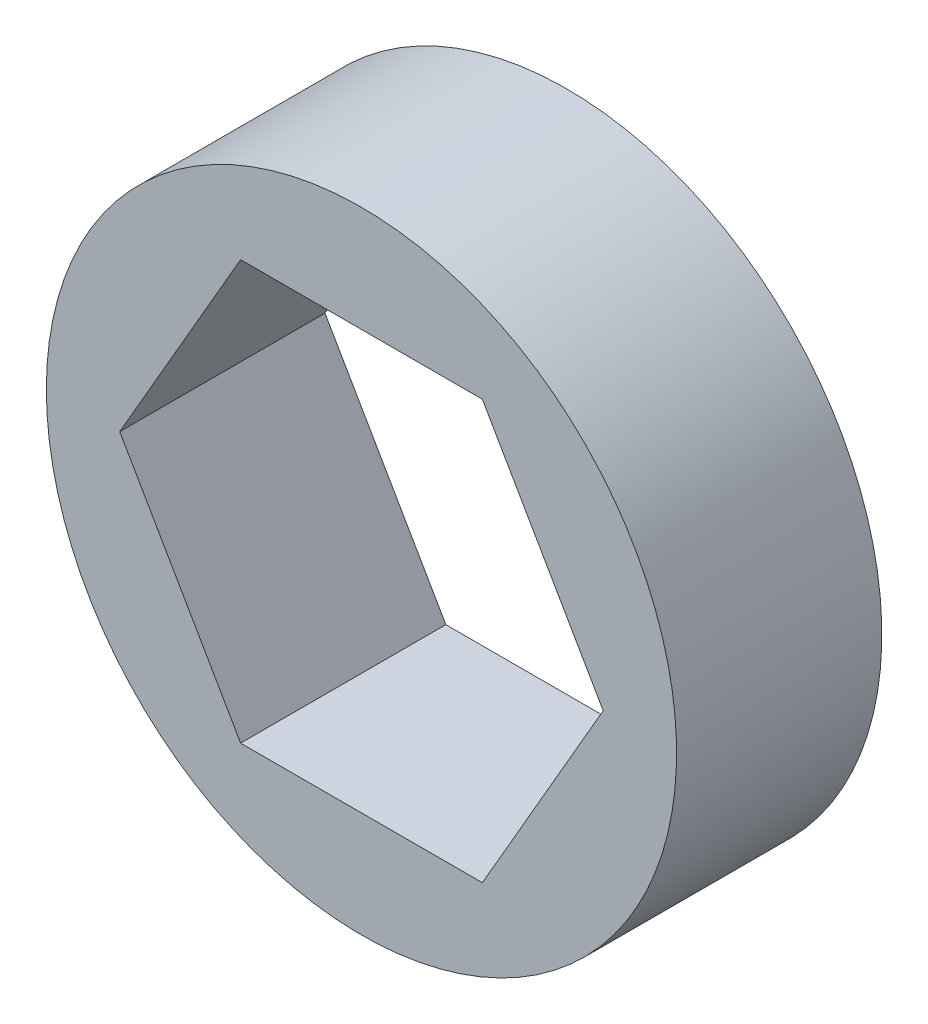
ISO-10303-21;
HEADER;
FILE_DESCRIPTION(('STEP AP214'),'2;1');
FILE_NAME('part.step','',(''),(''),'','','');
FILE_SCHEMA(('AUTOMOTIVE_DESIGN { 1 0 10303 214 1 1 1 1 }'));
ENDSEC;
DATA;
#1=APPLICATION_CONTEXT('core data for automotive mechanical design processes');
#2=APPLICATION_PROTOCOL_DEFINITION('international standard','automotive_design',2000,#1);
#3=PRODUCT_CONTEXT('',#1,'mechanical');
#4=PRODUCT('Part','Part','',(#3));
#5=PRODUCT_RELATED_PRODUCT_CATEGORY('part','',(#4));
#6=PRODUCT_DEFINITION_FORMATION('','',#4);
#7=PRODUCT_DEFINITION_CONTEXT('part definition',#1,'design');
#8=PRODUCT_DEFINITION('design','',#6,#7);
#9=PRODUCT_DEFINITION_SHAPE('','',#8);
#10=(LENGTH_UNIT() NAMED_UNIT(*) SI_UNIT(.MILLI.,.METRE.));
#11=(NAMED_UNIT(*) PLANE_ANGLE_UNIT() SI_UNIT($,.RADIAN.));
#12=(NAMED_UNIT(*) SI_UNIT($,.STERADIAN.) SOLID_ANGLE_UNIT());
#13=UNCERTAINTY_MEASURE_WITH_UNIT(LENGTH_MEASURE(1.E-05),#10,'distance_accuracy_value','');
#14=(GEOMETRIC_REPRESENTATION_CONTEXT(3) GLOBAL_UNCERTAINTY_ASSIGNED_CONTEXT((#13)) GLOBAL_UNIT_ASSIGNED_CONTEXT((#10,
#11,#12)) REPRESENTATION_CONTEXT('',''));
#15=CARTESIAN_POINT('',(0.,0.,0.));
#16=DIRECTION('',(0.,0.,1.));
#17=DIRECTION('',(1.,0.,0.));
#18=AXIS2_PLACEMENT_3D('',#15,#16,#17);
#19=CARTESIAN_POINT('',(-7.47899538708241,0.,3.175));
#20=DIRECTION('',(0.866025403784439,0.5,0.));
#21=DIRECTION('',(-0.5,0.866025403784439,0.));
#22=AXIS2_PLACEMENT_3D('',#19,#20,#21);
#23=PLANE('',#22);
#24=DIRECTION('',(-0.5,0.866025403784438,0.));
#25=VECTOR('',#24,1.);
#26=CARTESIAN_POINT('',(-3.73949769354121,-6.477,3.175));
#27=LINE('',#26,#25);
#28=CARTESIAN_POINT('',(-3.73949769354121,-6.477,3.175));
#29=VERTEX_POINT('',#28);
#30=CARTESIAN_POINT('',(-7.47899538708241,0.,3.175));
#31=VERTEX_POINT('',#30);
#32=EDGE_CURVE('E86',#29,#31,#27,.T.);
#33=ORIENTED_EDGE('',*,*,#32,.F.);
#34=DIRECTION('',(0.,0.,1.));
#35=VECTOR('',#34,1.);
#36=CARTESIAN_POINT('',(-3.73949769354121,-6.477,3.175));
#37=LINE('',#36,#35);
#38=CARTESIAN_POINT('',(-3.73949769354121,-6.477,-3.175));
#39=VERTEX_POINT('',#38);
#40=EDGE_CURVE('E78',#39,#29,#37,.T.);
#41=ORIENTED_EDGE('',*,*,#40,.F.);
#42=DIRECTION('',(-0.5,0.866025403784439,0.));
#43=VECTOR('',#42,1.);
#44=CARTESIAN_POINT('',(-3.73949769354121,-6.477,-3.175));
#45=LINE('',#44,#43);
#46=CARTESIAN_POINT('',(-7.47899538708241,0.,-3.175));
#47=VERTEX_POINT('',#46);
#48=EDGE_CURVE('E118',#39,#47,#45,.T.);
#49=ORIENTED_EDGE('',*,*,#48,.T.);
#50=DIRECTION('',(0.,0.,1.));
#51=VECTOR('',#50,1.);
#52=CARTESIAN_POINT('',(-7.47899538708241,0.,3.175));
#53=LINE('',#52,#51);
#54=EDGE_CURVE('E103',#31,#47,#53,.F.);
#55=ORIENTED_EDGE('',*,*,#54,.F.);
#56=EDGE_LOOP('',(#33,#41,#49,#55));
#57=FACE_BOUND('',#56,.T.);
#58=ADVANCED_FACE('F18',(#57),#23,.T.);
#59=CARTESIAN_POINT('',(-3.73949769354121,6.477,3.175));
#60=DIRECTION('',(0.866025403784439,-0.5,0.));
#61=DIRECTION('',(0.5,0.866025403784439,0.));
#62=AXIS2_PLACEMENT_3D('',#59,#60,#61);
#63=PLANE('',#62);
#64=DIRECTION('',(0.5,0.866025403784439,0.));
#65=VECTOR('',#64,1.);
#66=CARTESIAN_POINT('',(-7.47899538708242,0.,3.175));
#67=LINE('',#66,#65);
#68=CARTESIAN_POINT('',(-3.73949769354121,6.477,3.175));
#69=VERTEX_POINT('',#68);
#70=EDGE_CURVE('E111',#31,#69,#67,.T.);
#71=ORIENTED_EDGE('',*,*,#70,.F.);
#72=ORIENTED_EDGE('',*,*,#54,.T.);
#73=DIRECTION('',(0.5,0.866025403784439,0.));
#74=VECTOR('',#73,1.);
#75=CARTESIAN_POINT('',(-7.47899538708241,0.,-3.175));
#76=LINE('',#75,#74);
#77=CARTESIAN_POINT('',(-3.73949769354121,6.477,-3.175));
#78=VERTEX_POINT('',#77);
#79=EDGE_CURVE('E109',#47,#78,#76,.T.);
#80=ORIENTED_EDGE('',*,*,#79,.T.);
#81=DIRECTION('',(0.,0.,1.));
#82=VECTOR('',#81,1.);
#83=CARTESIAN_POINT('',(-3.73949769354121,6.477,3.175));
#84=LINE('',#83,#82);
#85=EDGE_CURVE('E100',#69,#78,#84,.F.);
#86=ORIENTED_EDGE('',*,*,#85,.F.);
#87=EDGE_LOOP('',(#71,#72,#80,#86));
#88=FACE_BOUND('',#87,.T.);
#89=ADVANCED_FACE('F108',(#88),#63,.T.);
#90=CARTESIAN_POINT('',(3.7394976935412,6.477,3.175));
#91=DIRECTION('',(0.,-1.,0.));
#92=DIRECTION('',(1.,0.,0.));
#93=AXIS2_PLACEMENT_3D('',#90,#91,#92);
#94=PLANE('',#93);
#95=DIRECTION('',(1.,0.,0.));
#96=VECTOR('',#95,1.);
#97=CARTESIAN_POINT('',(0.,6.477,3.175));
#98=LINE('',#97,#96);
#99=CARTESIAN_POINT('',(3.7394976935412,6.477,3.175));
#100=VERTEX_POINT('',#99);
#101=EDGE_CURVE('E130',#69,#100,#98,.T.);
#102=ORIENTED_EDGE('',*,*,#101,.F.);
#103=ORIENTED_EDGE('',*,*,#85,.T.);
#104=DIRECTION('',(1.,0.,0.));
#105=VECTOR('',#104,1.);
#106=CARTESIAN_POINT('',(0.,6.477,-3.175));
#107=LINE('',#106,#105);
#108=CARTESIAN_POINT('',(3.7394976935412,6.477,-3.175));
#109=VERTEX_POINT('',#108);
#110=EDGE_CURVE('E120',#78,#109,#107,.T.);
#111=ORIENTED_EDGE('',*,*,#110,.T.);
#112=DIRECTION('',(0.,0.,1.));
#113=VECTOR('',#112,1.);
#114=CARTESIAN_POINT('',(3.7394976935412,6.47700000000001,3.175));
#115=LINE('',#114,#113);
#116=EDGE_CURVE('E97',#100,#109,#115,.F.);
#117=ORIENTED_EDGE('',*,*,#116,.F.);
#118=EDGE_LOOP('',(#102,#103,#111,#117));
#119=FACE_BOUND('',#118,.T.);
#120=ADVANCED_FACE('F139',(#119),#94,.T.);
#121=CARTESIAN_POINT('',(7.47899538708241,0.,3.175));
#122=DIRECTION('',(-0.866025403784439,-0.5,0.));
#123=DIRECTION('',(0.5,-0.866025403784439,0.));
#124=AXIS2_PLACEMENT_3D('',#121,#122,#123);
#125=PLANE('',#124);
#126=DIRECTION('',(0.5,-0.866025403784438,0.));
#127=VECTOR('',#126,1.);
#128=CARTESIAN_POINT('',(3.7394976935412,6.477,3.175));
#129=LINE('',#128,#127);
#130=CARTESIAN_POINT('',(7.47899538708242,0.,3.175));
#131=VERTEX_POINT('',#130);
#132=EDGE_CURVE('E91',#100,#131,#129,.T.);
#133=ORIENTED_EDGE('',*,*,#132,.F.);
#134=ORIENTED_EDGE('',*,*,#116,.T.);
#135=DIRECTION('',(0.5,-0.866025403784438,0.));
#136=VECTOR('',#135,1.);
#137=CARTESIAN_POINT('',(3.7394976935412,6.477,-3.175));
#138=LINE('',#137,#136);
#139=CARTESIAN_POINT('',(7.47899538708241,0.,-3.175));
#140=VERTEX_POINT('',#139);
#141=EDGE_CURVE('E124',#109,#140,#138,.T.);
#142=ORIENTED_EDGE('',*,*,#141,.T.);
#143=DIRECTION('',(0.,0.,1.));
#144=VECTOR('',#143,1.);
#145=CARTESIAN_POINT('',(7.47899538708242,0.,3.175));
#146=LINE('',#145,#144);
#147=EDGE_CURVE('E67',#131,#140,#146,.F.);
#148=ORIENTED_EDGE('',*,*,#147,.F.);
#149=EDGE_LOOP('',(#133,#134,#142,#148));
#150=FACE_BOUND('',#149,.T.);
#151=ADVANCED_FACE('F136',(#150),#125,.T.);
#152=CARTESIAN_POINT('',(3.73949769354121,-6.477,3.175));
#153=DIRECTION('',(-0.866025403784439,0.5,0.));
#154=DIRECTION('',(-0.5,-0.866025403784439,0.));
#155=AXIS2_PLACEMENT_3D('',#152,#153,#154);
#156=PLANE('',#155);
#157=DIRECTION('',(-0.5,-0.866025403784439,0.));
#158=VECTOR('',#157,1.);
#159=CARTESIAN_POINT('',(7.47899538708241,0.,3.175));
#160=LINE('',#159,#158);
#161=CARTESIAN_POINT('',(3.73949769354121,-6.477,3.175));
#162=VERTEX_POINT('',#161);
#163=EDGE_CURVE('E73',#131,#162,#160,.T.);
#164=ORIENTED_EDGE('',*,*,#163,.F.);
#165=ORIENTED_EDGE('',*,*,#147,.T.);
#166=DIRECTION('',(-0.5,-0.866025403784439,0.));
#167=VECTOR('',#166,1.);
#168=CARTESIAN_POINT('',(7.47899538708241,0.,-3.175));
#169=LINE('',#168,#167);
#170=CARTESIAN_POINT('',(3.73949769354121,-6.477,-3.175));
#171=VERTEX_POINT('',#170);
#172=EDGE_CURVE('E35',#140,#171,#169,.T.);
#173=ORIENTED_EDGE('',*,*,#172,.T.);
#174=DIRECTION('',(0.,0.,1.));
#175=VECTOR('',#174,1.);
#176=CARTESIAN_POINT('',(3.73949769354121,-6.477,3.175));
#177=LINE('',#176,#175);
#178=EDGE_CURVE('E69',#162,#171,#177,.F.);
#179=ORIENTED_EDGE('',*,*,#178,.F.);
#180=EDGE_LOOP('',(#164,#165,#173,#179));
#181=FACE_BOUND('',#180,.T.);
#182=ADVANCED_FACE('F71',(#181),#156,.T.);
#183=CARTESIAN_POINT('',(-3.73949769354121,-6.477,3.175));
#184=DIRECTION('',(0.,1.,0.));
#185=DIRECTION('',(0.,0.,1.));
#186=AXIS2_PLACEMENT_3D('',#183,#184,#185);
#187=PLANE('',#186);
#188=DIRECTION('',(1.,0.,0.));
#189=VECTOR('',#188,1.);
#190=CARTESIAN_POINT('',(0.,-6.477,3.175));
#191=LINE('',#190,#189);
#192=EDGE_CURVE('E81',#162,#29,#191,.F.);
#193=ORIENTED_EDGE('',*,*,#192,.F.);
#194=ORIENTED_EDGE('',*,*,#178,.T.);
#195=DIRECTION('',(1.,0.,0.));
#196=VECTOR('',#195,1.);
#197=CARTESIAN_POINT('',(0.,-6.477,-3.175));
#198=LINE('',#197,#196);
#199=EDGE_CURVE('E132',#171,#39,#198,.F.);
#200=ORIENTED_EDGE('',*,*,#199,.T.);
#201=ORIENTED_EDGE('',*,*,#40,.T.);
#202=EDGE_LOOP('',(#193,#194,#200,#201));
#203=FACE_BOUND('',#202,.T.);
#204=ADVANCED_FACE('F82',(#203),#187,.T.);
#205=CARTESIAN_POINT('',(0.,0.,3.175));
#206=DIRECTION('',(0.,0.,1.));
#207=DIRECTION('',(1.,0.,0.));
#208=AXIS2_PLACEMENT_3D('',#205,#206,#207);
#209=PLANE('',#208);
#210=ORIENTED_EDGE('',*,*,#101,.T.);
#211=ORIENTED_EDGE('',*,*,#132,.T.);
#212=ORIENTED_EDGE('',*,*,#163,.T.);
#213=ORIENTED_EDGE('',*,*,#192,.T.);
#214=ORIENTED_EDGE('',*,*,#32,.T.);
#215=ORIENTED_EDGE('',*,*,#70,.T.);
#216=EDGE_LOOP('',(#210,#211,#212,#213,#214,#215));
#217=FACE_BOUND('',#216,.T.);
#218=CARTESIAN_POINT('',(0.,0.,3.175));
#219=DIRECTION('',(0.,0.,-1.));
#220=DIRECTION('',(-1.,0.,0.));
#221=AXIS2_PLACEMENT_3D('',#218,#219,#220);
#222=CIRCLE('',#221,9.75);
#223=CARTESIAN_POINT('',(-9.75,0.,3.175));
#224=VERTEX_POINT('',#223);
#225=EDGE_CURVE('E21',#224,#224,#222,.T.);
#226=ORIENTED_EDGE('',*,*,#225,.F.);
#227=EDGE_LOOP('',(#226));
#228=FACE_BOUND('',#227,.T.);
#229=ADVANCED_FACE('F89',(#217,#228),#209,.T.);
#230=CARTESIAN_POINT('',(0.,0.,-3.175));
#231=DIRECTION('',(0.,0.,1.));
#232=DIRECTION('',(1.,0.,0.));
#233=AXIS2_PLACEMENT_3D('',#230,#231,#232);
#234=PLANE('',#233);
#235=ORIENTED_EDGE('',*,*,#172,.F.);
#236=ORIENTED_EDGE('',*,*,#141,.F.);
#237=ORIENTED_EDGE('',*,*,#110,.F.);
#238=ORIENTED_EDGE('',*,*,#79,.F.);
#239=ORIENTED_EDGE('',*,*,#48,.F.);
#240=ORIENTED_EDGE('',*,*,#199,.F.);
#241=EDGE_LOOP('',(#235,#236,#237,#238,#239,#240));
#242=FACE_BOUND('',#241,.T.);
#243=CARTESIAN_POINT('',(0.,0.,-3.175));
#244=DIRECTION('',(0.,0.,-1.));
#245=DIRECTION('',(-1.,0.,0.));
#246=AXIS2_PLACEMENT_3D('',#243,#244,#245);
#247=CIRCLE('',#246,9.75);
#248=CARTESIAN_POINT('',(-9.75,0.,-3.175));
#249=VERTEX_POINT('',#248);
#250=EDGE_CURVE('E11',#249,#249,#247,.F.);
#251=ORIENTED_EDGE('',*,*,#250,.F.);
#252=EDGE_LOOP('',(#251));
#253=FACE_BOUND('',#252,.T.);
#254=ADVANCED_FACE('F116',(#242,#253),#234,.F.);
#255=CARTESIAN_POINT('',(0.,0.,3.175));
#256=DIRECTION('',(0.,0.,-1.));
#257=DIRECTION('',(-1.,0.,0.));
#258=AXIS2_PLACEMENT_3D('',#255,#256,#257);
#259=CYLINDRICAL_SURFACE('',#258,9.75);
#260=ORIENTED_EDGE('',*,*,#250,.T.);
#261=EDGE_LOOP('',(#260));
#262=FACE_BOUND('',#261,.T.);
#263=ORIENTED_EDGE('',*,*,#225,.T.);
#264=EDGE_LOOP('',(#263));
#265=FACE_BOUND('',#264,.T.);
#266=ADVANCED_FACE('F148',(#262,#265),#259,.T.);
#267=CLOSED_SHELL('',(#58,#89,#120,#151,#182,#204,#229,#254,#266));
#268=MANIFOLD_SOLID_BREP('B1',#267);
#269=ADVANCED_BREP_SHAPE_REPRESENTATION('',(#18,#268),#14);
#270=SHAPE_DEFINITION_REPRESENTATION(#9,#269);
ENDSEC;
END-ISO-10303-21;
